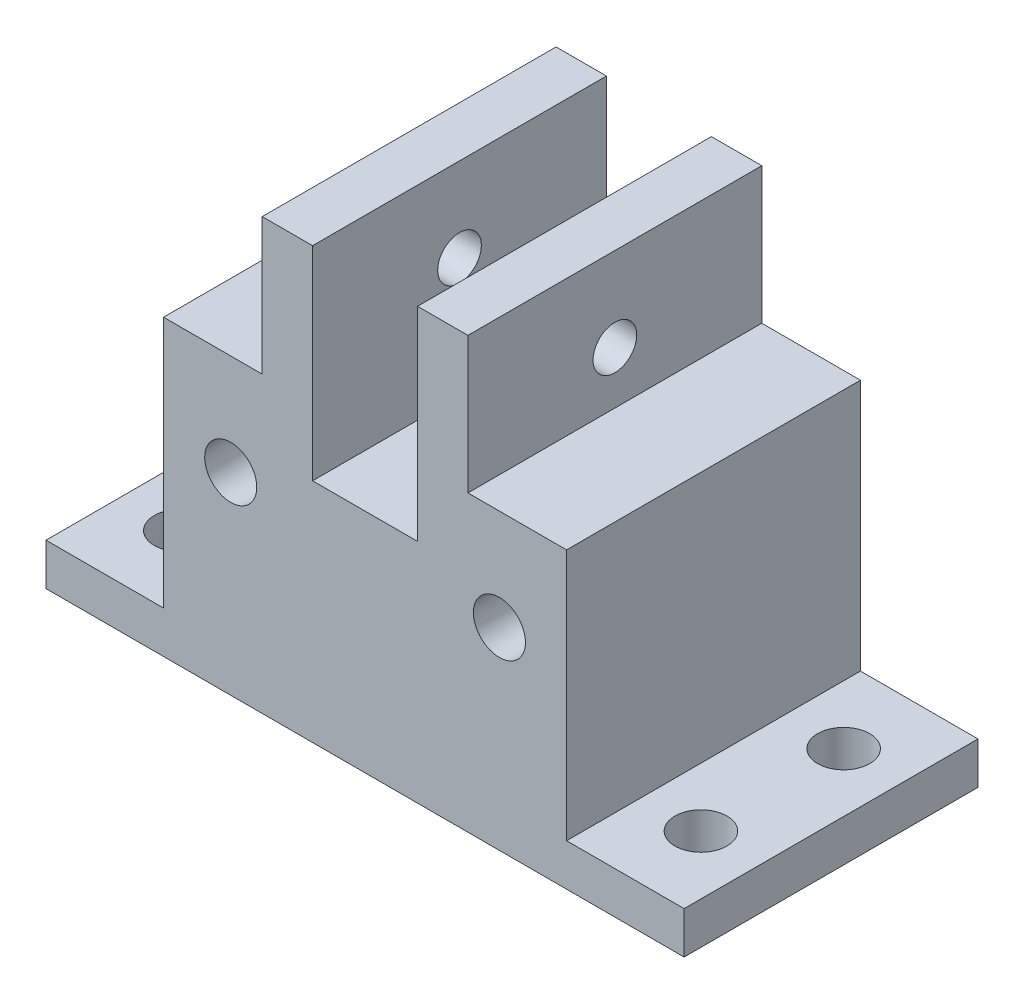
ISO-10303-21;
HEADER;
FILE_DESCRIPTION(('STEP AP214'),'2;1');
FILE_NAME('part.step','',(''),(''),'','','');
FILE_SCHEMA(('AUTOMOTIVE_DESIGN { 1 0 10303 214 1 1 1 1 }'));
ENDSEC;
DATA;
#1=APPLICATION_CONTEXT('core data for automotive mechanical design processes');
#2=APPLICATION_PROTOCOL_DEFINITION('international standard','automotive_design',2000,#1);
#3=PRODUCT_CONTEXT('',#1,'mechanical');
#4=PRODUCT('Part','Part','',(#3));
#5=PRODUCT_RELATED_PRODUCT_CATEGORY('part','',(#4));
#6=PRODUCT_DEFINITION_FORMATION('','',#4);
#7=PRODUCT_DEFINITION_CONTEXT('part definition',#1,'design');
#8=PRODUCT_DEFINITION('design','',#6,#7);
#9=PRODUCT_DEFINITION_SHAPE('','',#8);
#10=(LENGTH_UNIT() NAMED_UNIT(*) SI_UNIT(.MILLI.,.METRE.));
#11=(NAMED_UNIT(*) PLANE_ANGLE_UNIT() SI_UNIT($,.RADIAN.));
#12=(NAMED_UNIT(*) SI_UNIT($,.STERADIAN.) SOLID_ANGLE_UNIT());
#13=UNCERTAINTY_MEASURE_WITH_UNIT(LENGTH_MEASURE(1.E-05),#10,'distance_accuracy_value','');
#14=(GEOMETRIC_REPRESENTATION_CONTEXT(3) GLOBAL_UNCERTAINTY_ASSIGNED_CONTEXT((#13)) GLOBAL_UNIT_ASSIGNED_CONTEXT((#10,
#11,#12)) REPRESENTATION_CONTEXT('',''));
#15=CARTESIAN_POINT('',(0.,0.,0.));
#16=DIRECTION('',(0.,0.,1.));
#17=DIRECTION('',(1.,0.,0.));
#18=AXIS2_PLACEMENT_3D('',#15,#16,#17);
#19=CARTESIAN_POINT('',(-4.9999999999991,-3.75000000000025,35.));
#20=DIRECTION('',(0.,-1.,0.));
#21=DIRECTION('',(0.,0.,-1.));
#22=AXIS2_PLACEMENT_3D('',#19,#20,#21);
#23=PLANE('',#22);
#24=DIRECTION('',(-1.,0.,0.));
#25=VECTOR('',#24,1.);
#26=CARTESIAN_POINT('',(-4.9999999999991,-3.75000000000025,35.));
#27=LINE('',#26,#25);
#28=CARTESIAN_POINT('',(-23.2499999999998,-3.75000000000025,35.));
#29=VERTEX_POINT('',#28);
#30=CARTESIAN_POINT('',(-35.,-3.75000000000025,35.));
#31=VERTEX_POINT('',#30);
#32=EDGE_CURVE('E358',#29,#31,#27,.T.);
#33=ORIENTED_EDGE('',*,*,#32,.F.);
#34=DIRECTION('',(0.,0.,-1.));
#35=VECTOR('',#34,1.);
#36=CARTESIAN_POINT('',(-23.2499999999998,-3.75000000000025,35.));
#37=LINE('',#36,#35);
#38=CARTESIAN_POINT('',(-23.2499999999998,-3.75000000000025,0.));
#39=VERTEX_POINT('',#38);
#40=EDGE_CURVE('E53',#29,#39,#37,.T.);
#41=ORIENTED_EDGE('',*,*,#40,.T.);
#42=DIRECTION('',(-1.,0.,0.));
#43=VECTOR('',#42,1.);
#44=CARTESIAN_POINT('',(-4.9999999999991,-3.75000000000025,0.));
#45=LINE('',#44,#43);
#46=CARTESIAN_POINT('',(-35.,-3.75000000000025,0.));
#47=VERTEX_POINT('',#46);
#48=EDGE_CURVE('E371',#39,#47,#45,.T.);
#49=ORIENTED_EDGE('',*,*,#48,.T.);
#50=DIRECTION('',(0.,0.,-1.));
#51=VECTOR('',#50,1.);
#52=CARTESIAN_POINT('',(-35.,-3.75000000000025,35.));
#53=LINE('',#52,#51);
#54=EDGE_CURVE('E368',#31,#47,#53,.T.);
#55=ORIENTED_EDGE('',*,*,#54,.F.);
#56=EDGE_LOOP('',(#33,#41,#49,#55));
#57=FACE_BOUND('',#56,.T.);
#58=ADVANCED_FACE('F43',(#57),#23,.F.);
#59=CARTESIAN_POINT('',(5.00000000000002,-15.75,35.));
#60=DIRECTION('',(0.,0.,-1.));
#61=DIRECTION('',(-1.,0.,0.));
#62=AXIS2_PLACEMENT_3D('',#59,#60,#61);
#63=CYLINDRICAL_SURFACE('',#62,3.1);
#64=CARTESIAN_POINT('',(5.00000000000002,-15.75,35.));
#65=DIRECTION('',(0.,0.,1.));
#66=DIRECTION('',(1.,0.,0.));
#67=AXIS2_PLACEMENT_3D('',#64,#65,#66);
#68=CIRCLE('',#67,3.1);
#69=CARTESIAN_POINT('',(8.10000000000002,-15.75,35.));
#70=VERTEX_POINT('',#69);
#71=EDGE_CURVE('E350',#70,#70,#68,.T.);
#72=ORIENTED_EDGE('',*,*,#71,.T.);
#73=EDGE_LOOP('',(#72));
#74=FACE_BOUND('',#73,.T.);
#75=CARTESIAN_POINT('',(5.00000000000002,-15.75,5.));
#76=DIRECTION('',(0.,0.,-1.));
#77=DIRECTION('',(-1.,0.,0.));
#78=AXIS2_PLACEMENT_3D('',#75,#76,#77);
#79=CIRCLE('',#78,3.1);
#80=CARTESIAN_POINT('',(1.90000000000002,-15.75,5.));
#81=VERTEX_POINT('',#80);
#82=EDGE_CURVE('E338',#81,#81,#79,.T.);
#83=ORIENTED_EDGE('',*,*,#82,.T.);
#84=EDGE_LOOP('',(#83));
#85=FACE_BOUND('',#84,.T.);
#86=ADVANCED_FACE('F461',(#74,#85),#63,.F.);
#87=CARTESIAN_POINT('',(-27.,-15.7500000000003,35.));
#88=DIRECTION('',(0.,0.,-1.));
#89=DIRECTION('',(-1.,0.,0.));
#90=AXIS2_PLACEMENT_3D('',#87,#88,#89);
#91=CYLINDRICAL_SURFACE('',#90,3.1);
#92=CARTESIAN_POINT('',(-27.,-15.7500000000003,35.));
#93=DIRECTION('',(0.,0.,1.));
#94=DIRECTION('',(1.,0.,0.));
#95=AXIS2_PLACEMENT_3D('',#92,#93,#94);
#96=CIRCLE('',#95,3.1);
#97=CARTESIAN_POINT('',(-23.9,-15.7500000000003,35.));
#98=VERTEX_POINT('',#97);
#99=EDGE_CURVE('E346',#98,#98,#96,.T.);
#100=ORIENTED_EDGE('',*,*,#99,.T.);
#101=EDGE_LOOP('',(#100));
#102=FACE_BOUND('',#101,.T.);
#103=CARTESIAN_POINT('',(-27.,-15.7500000000003,5.));
#104=DIRECTION('',(0.,0.,-1.));
#105=DIRECTION('',(-1.,0.,0.));
#106=AXIS2_PLACEMENT_3D('',#103,#104,#105);
#107=CIRCLE('',#106,3.1);
#108=CARTESIAN_POINT('',(-30.1,-15.7500000000003,5.));
#109=VERTEX_POINT('',#108);
#110=EDGE_CURVE('E342',#109,#109,#107,.T.);
#111=ORIENTED_EDGE('',*,*,#110,.T.);
#112=EDGE_LOOP('',(#111));
#113=FACE_BOUND('',#112,.T.);
#114=ADVANCED_FACE('F465',(#102,#113),#91,.F.);
#115=CARTESIAN_POINT('',(0.,0.,35.));
#116=DIRECTION('',(0.,0.,-1.));
#117=DIRECTION('',(-1.,0.,0.));
#118=AXIS2_PLACEMENT_3D('',#115,#116,#117);
#119=PLANE('',#118);
#120=DIRECTION('',(0.,-1.,0.));
#121=VECTOR('',#120,1.);
#122=CARTESIAN_POINT('',(-4.7499999999998,2.49999999999976,35.));
#123=LINE('',#122,#121);
#124=CARTESIAN_POINT('',(-4.7499999999998,12.4999999999998,35.));
#125=VERTEX_POINT('',#124);
#126=CARTESIAN_POINT('',(-4.7499999999998,-11.7500000000003,35.));
#127=VERTEX_POINT('',#126);
#128=EDGE_CURVE('E301',#125,#127,#123,.T.);
#129=ORIENTED_EDGE('',*,*,#128,.T.);
#130=DIRECTION('',(1.,0.,0.));
#131=VECTOR('',#130,1.);
#132=CARTESIAN_POINT('',(-17.2499999999998,-11.7500000000003,35.));
#133=LINE('',#132,#131);
#134=CARTESIAN_POINT('',(-17.2499999999998,-11.7500000000003,35.));
#135=VERTEX_POINT('',#134);
#136=EDGE_CURVE('E256',#135,#127,#133,.T.);
#137=ORIENTED_EDGE('',*,*,#136,.F.);
#138=DIRECTION('',(0.,1.,0.));
#139=VECTOR('',#138,1.);
#140=CARTESIAN_POINT('',(-17.2499999999998,2.49999999999976,35.));
#141=LINE('',#140,#139);
#142=CARTESIAN_POINT('',(-17.2499999999998,12.4999999999998,35.));
#143=VERTEX_POINT('',#142);
#144=EDGE_CURVE('E310',#135,#143,#141,.T.);
#145=ORIENTED_EDGE('',*,*,#144,.T.);
#146=DIRECTION('',(-1.,0.,0.));
#147=VECTOR('',#146,1.);
#148=CARTESIAN_POINT('',(-17.2499999999998,12.4999999999998,35.));
#149=LINE('',#148,#147);
#150=CARTESIAN_POINT('',(-23.2499999999998,12.4999999999998,35.));
#151=VERTEX_POINT('',#150);
#152=EDGE_CURVE('E313',#143,#151,#149,.T.);
#153=ORIENTED_EDGE('',*,*,#152,.T.);
#154=DIRECTION('',(0.,-1.,0.));
#155=VECTOR('',#154,1.);
#156=CARTESIAN_POINT('',(-23.2499999999998,12.4999999999998,35.));
#157=LINE('',#156,#155);
#158=EDGE_CURVE('E314',#151,#29,#157,.T.);
#159=ORIENTED_EDGE('',*,*,#158,.T.);
#160=ORIENTED_EDGE('',*,*,#32,.T.);
#161=DIRECTION('',(0.,-1.,0.));
#162=VECTOR('',#161,1.);
#163=CARTESIAN_POINT('',(-35.,-3.75000000000025,35.));
#164=LINE('',#163,#162);
#165=CARTESIAN_POINT('',(-34.9999999999998,-33.7500000000002,35.));
#166=VERTEX_POINT('',#165);
#167=EDGE_CURVE('E364',#31,#166,#164,.T.);
#168=ORIENTED_EDGE('',*,*,#167,.T.);
#169=DIRECTION('',(-1.,0.,0.));
#170=VECTOR('',#169,1.);
#171=CARTESIAN_POINT('',(-34.9999999999998,-33.7500000000002,35.));
#172=LINE('',#171,#170);
#173=CARTESIAN_POINT('',(-48.9999999999998,-33.7500000000002,35.));
#174=VERTEX_POINT('',#173);
#175=EDGE_CURVE('E68',#166,#174,#172,.T.);
#176=ORIENTED_EDGE('',*,*,#175,.T.);
#177=DIRECTION('',(0.,-1.,0.));
#178=VECTOR('',#177,1.);
#179=CARTESIAN_POINT('',(-48.9999999999998,-33.7500000000002,35.));
#180=LINE('',#179,#178);
#181=CARTESIAN_POINT('',(-48.9999999999998,-38.7500000000002,35.));
#182=VERTEX_POINT('',#181);
#183=EDGE_CURVE('E246',#174,#182,#180,.T.);
#184=ORIENTED_EDGE('',*,*,#183,.T.);
#185=DIRECTION('',(-1.,0.,0.));
#186=VECTOR('',#185,1.);
#187=CARTESIAN_POINT('',(13.0000000000002,-38.7500000000002,35.));
#188=LINE('',#187,#186);
#189=CARTESIAN_POINT('',(27.0000000000002,-38.7500000000002,35.));
#190=VERTEX_POINT('',#189);
#191=EDGE_CURVE('E171',#190,#182,#188,.T.);
#192=ORIENTED_EDGE('',*,*,#191,.F.);
#193=DIRECTION('',(0.,-1.,0.));
#194=VECTOR('',#193,1.);
#195=CARTESIAN_POINT('',(27.0000000000002,-33.7500000000002,35.));
#196=LINE('',#195,#194);
#197=CARTESIAN_POINT('',(27.0000000000002,-33.7500000000002,35.));
#198=VERTEX_POINT('',#197);
#199=EDGE_CURVE('E181',#198,#190,#196,.T.);
#200=ORIENTED_EDGE('',*,*,#199,.F.);
#201=DIRECTION('',(-1.,0.,0.));
#202=VECTOR('',#201,1.);
#203=CARTESIAN_POINT('',(13.0000000000002,-33.7500000000002,35.));
#204=LINE('',#203,#202);
#205=CARTESIAN_POINT('',(13.0000000000002,-33.7500000000002,35.));
#206=VERTEX_POINT('',#205);
#207=EDGE_CURVE('E194',#198,#206,#204,.T.);
#208=ORIENTED_EDGE('',*,*,#207,.T.);
#209=DIRECTION('',(0.,1.,0.));
#210=VECTOR('',#209,1.);
#211=CARTESIAN_POINT('',(13.0000000000002,-28.7500000000002,35.));
#212=LINE('',#211,#210);
#213=CARTESIAN_POINT('',(13.0000000000002,-3.75000000000025,35.));
#214=VERTEX_POINT('',#213);
#215=EDGE_CURVE('E355',#206,#214,#212,.T.);
#216=ORIENTED_EDGE('',*,*,#215,.T.);
#217=CARTESIAN_POINT('',(1.25000000000019,-3.75000000000025,35.));
#218=VERTEX_POINT('',#217);
#219=EDGE_CURVE('E360',#214,#218,#27,.T.);
#220=ORIENTED_EDGE('',*,*,#219,.T.);
#221=DIRECTION('',(0.,1.,0.));
#222=VECTOR('',#221,1.);
#223=CARTESIAN_POINT('',(1.2500000000002,12.4999999999998,35.));
#224=LINE('',#223,#222);
#225=CARTESIAN_POINT('',(1.2500000000002,12.4999999999998,35.));
#226=VERTEX_POINT('',#225);
#227=EDGE_CURVE('E300',#218,#226,#224,.T.);
#228=ORIENTED_EDGE('',*,*,#227,.T.);
#229=DIRECTION('',(-1.,0.,0.));
#230=VECTOR('',#229,1.);
#231=CARTESIAN_POINT('',(-4.7499999999998,12.4999999999998,35.));
#232=LINE('',#231,#230);
#233=EDGE_CURVE('E304',#226,#125,#232,.T.);
#234=ORIENTED_EDGE('',*,*,#233,.T.);
#235=EDGE_LOOP('',(#129,#137,#145,#153,#159,#160,#168,#176,#184,#192,#200,#208,#216,#220,#228,#234));
#236=FACE_BOUND('',#235,.T.);
#237=ORIENTED_EDGE('',*,*,#71,.F.);
#238=EDGE_LOOP('',(#237));
#239=FACE_BOUND('',#238,.T.);
#240=ORIENTED_EDGE('',*,*,#99,.F.);
#241=EDGE_LOOP('',(#240));
#242=FACE_BOUND('',#241,.T.);
#243=ADVANCED_FACE('F423',(#236,#239,#242),#119,.F.);
#244=CARTESIAN_POINT('',(0.,0.,0.));
#245=DIRECTION('',(0.,0.,-1.));
#246=DIRECTION('',(-1.,0.,0.));
#247=AXIS2_PLACEMENT_3D('',#244,#245,#246);
#248=PLANE('',#247);
#249=DIRECTION('',(1.,0.,0.));
#250=VECTOR('',#249,1.);
#251=CARTESIAN_POINT('',(-17.2499999999998,-11.7500000000003,0.));
#252=LINE('',#251,#250);
#253=CARTESIAN_POINT('',(-17.2499999999998,-11.7500000000003,0.));
#254=VERTEX_POINT('',#253);
#255=CARTESIAN_POINT('',(-4.7499999999998,-11.7500000000003,0.));
#256=VERTEX_POINT('',#255);
#257=EDGE_CURVE('E257',#254,#256,#252,.T.);
#258=ORIENTED_EDGE('',*,*,#257,.T.);
#259=DIRECTION('',(0.,-1.,0.));
#260=VECTOR('',#259,1.);
#261=CARTESIAN_POINT('',(-4.7499999999998,2.49999999999976,0.));
#262=LINE('',#261,#260);
#263=CARTESIAN_POINT('',(-4.7499999999998,12.4999999999998,0.));
#264=VERTEX_POINT('',#263);
#265=EDGE_CURVE('E294',#264,#256,#262,.T.);
#266=ORIENTED_EDGE('',*,*,#265,.F.);
#267=DIRECTION('',(-1.,0.,0.));
#268=VECTOR('',#267,1.);
#269=CARTESIAN_POINT('',(-4.7499999999998,12.4999999999998,0.));
#270=LINE('',#269,#268);
#271=CARTESIAN_POINT('',(1.2500000000002,12.4999999999998,0.));
#272=VERTEX_POINT('',#271);
#273=EDGE_CURVE('E289',#272,#264,#270,.T.);
#274=ORIENTED_EDGE('',*,*,#273,.F.);
#275=DIRECTION('',(0.,1.,0.));
#276=VECTOR('',#275,1.);
#277=CARTESIAN_POINT('',(1.2500000000002,12.4999999999998,0.));
#278=LINE('',#277,#276);
#279=CARTESIAN_POINT('',(1.25000000000019,-3.75000000000025,0.));
#280=VERTEX_POINT('',#279);
#281=EDGE_CURVE('E288',#280,#272,#278,.T.);
#282=ORIENTED_EDGE('',*,*,#281,.F.);
#283=CARTESIAN_POINT('',(13.0000000000002,-3.75000000000025,0.));
#284=VERTEX_POINT('',#283);
#285=EDGE_CURVE('E372',#284,#280,#45,.T.);
#286=ORIENTED_EDGE('',*,*,#285,.F.);
#287=DIRECTION('',(0.,1.,0.));
#288=VECTOR('',#287,1.);
#289=CARTESIAN_POINT('',(13.0000000000002,-28.7500000000002,0.));
#290=LINE('',#289,#288);
#291=CARTESIAN_POINT('',(13.0000000000002,-33.7500000000002,0.));
#292=VERTEX_POINT('',#291);
#293=EDGE_CURVE('E354',#292,#284,#290,.T.);
#294=ORIENTED_EDGE('',*,*,#293,.F.);
#295=DIRECTION('',(1.,0.,0.));
#296=VECTOR('',#295,1.);
#297=CARTESIAN_POINT('',(27.0000000000002,-33.7500000000002,0.));
#298=LINE('',#297,#296);
#299=CARTESIAN_POINT('',(27.0000000000002,-33.7500000000002,0.));
#300=VERTEX_POINT('',#299);
#301=EDGE_CURVE('E60',#292,#300,#298,.T.);
#302=ORIENTED_EDGE('',*,*,#301,.T.);
#303=DIRECTION('',(0.,-1.,0.));
#304=VECTOR('',#303,1.);
#305=CARTESIAN_POINT('',(27.0000000000002,-33.7500000000002,0.));
#306=LINE('',#305,#304);
#307=CARTESIAN_POINT('',(27.0000000000002,-38.7500000000002,0.));
#308=VERTEX_POINT('',#307);
#309=EDGE_CURVE('E174',#300,#308,#306,.T.);
#310=ORIENTED_EDGE('',*,*,#309,.T.);
#311=DIRECTION('',(1.,0.,0.));
#312=VECTOR('',#311,1.);
#313=CARTESIAN_POINT('',(-34.9999999999998,-38.7500000000002,0.));
#314=LINE('',#313,#312);
#315=CARTESIAN_POINT('',(-48.9999999999998,-38.7500000000002,0.));
#316=VERTEX_POINT('',#315);
#317=EDGE_CURVE('E160',#316,#308,#314,.T.);
#318=ORIENTED_EDGE('',*,*,#317,.F.);
#319=DIRECTION('',(0.,-1.,0.));
#320=VECTOR('',#319,1.);
#321=CARTESIAN_POINT('',(-48.9999999999998,-33.7500000000002,0.));
#322=LINE('',#321,#320);
#323=CARTESIAN_POINT('',(-48.9999999999998,-33.7500000000002,0.));
#324=VERTEX_POINT('',#323);
#325=EDGE_CURVE('E172',#324,#316,#322,.T.);
#326=ORIENTED_EDGE('',*,*,#325,.F.);
#327=DIRECTION('',(1.,0.,0.));
#328=VECTOR('',#327,1.);
#329=CARTESIAN_POINT('',(-48.9999999999998,-33.7500000000002,0.));
#330=LINE('',#329,#328);
#331=CARTESIAN_POINT('',(-34.9999999999998,-33.7500000000002,0.));
#332=VERTEX_POINT('',#331);
#333=EDGE_CURVE('E242',#324,#332,#330,.T.);
#334=ORIENTED_EDGE('',*,*,#333,.T.);
#335=DIRECTION('',(0.,-1.,0.));
#336=VECTOR('',#335,1.);
#337=CARTESIAN_POINT('',(-35.,-3.75000000000025,0.));
#338=LINE('',#337,#336);
#339=EDGE_CURVE('E359',#47,#332,#338,.T.);
#340=ORIENTED_EDGE('',*,*,#339,.F.);
#341=ORIENTED_EDGE('',*,*,#48,.F.);
#342=DIRECTION('',(0.,-1.,0.));
#343=VECTOR('',#342,1.);
#344=CARTESIAN_POINT('',(-23.2499999999998,12.4999999999998,0.));
#345=LINE('',#344,#343);
#346=CARTESIAN_POINT('',(-23.2499999999998,12.4999999999998,0.));
#347=VERTEX_POINT('',#346);
#348=EDGE_CURVE('E330',#347,#39,#345,.T.);
#349=ORIENTED_EDGE('',*,*,#348,.F.);
#350=DIRECTION('',(-1.,0.,0.));
#351=VECTOR('',#350,1.);
#352=CARTESIAN_POINT('',(-17.2499999999998,12.4999999999998,0.));
#353=LINE('',#352,#351);
#354=CARTESIAN_POINT('',(-17.2499999999998,12.4999999999998,0.));
#355=VERTEX_POINT('',#354);
#356=EDGE_CURVE('E318',#355,#347,#353,.T.);
#357=ORIENTED_EDGE('',*,*,#356,.F.);
#358=DIRECTION('',(0.,1.,0.));
#359=VECTOR('',#358,1.);
#360=CARTESIAN_POINT('',(-17.2499999999998,2.49999999999976,0.));
#361=LINE('',#360,#359);
#362=EDGE_CURVE('E326',#254,#355,#361,.T.);
#363=ORIENTED_EDGE('',*,*,#362,.F.);
#364=EDGE_LOOP('',(#258,#266,#274,#282,#286,#294,#302,#310,#318,#326,#334,#340,#341,#349,#357,#363));
#365=FACE_BOUND('',#364,.T.);
#366=ADVANCED_FACE('F176',(#365),#248,.T.);
#367=CARTESIAN_POINT('',(13.0000000000002,-28.7500000000002,35.));
#368=DIRECTION('',(-1.,0.,0.));
#369=DIRECTION('',(0.,0.,1.));
#370=AXIS2_PLACEMENT_3D('',#367,#368,#369);
#371=PLANE('',#370);
#372=ORIENTED_EDGE('',*,*,#215,.F.);
#373=DIRECTION('',(0.,0.,-1.));
#374=VECTOR('',#373,1.);
#375=CARTESIAN_POINT('',(13.0000000000002,-33.7500000000002,35.));
#376=LINE('',#375,#374);
#377=EDGE_CURVE('E200',#206,#292,#376,.T.);
#378=ORIENTED_EDGE('',*,*,#377,.T.);
#379=ORIENTED_EDGE('',*,*,#293,.T.);
#380=DIRECTION('',(0.,0.,-1.));
#381=VECTOR('',#380,1.);
#382=CARTESIAN_POINT('',(13.0000000000002,-3.75000000000025,35.));
#383=LINE('',#382,#381);
#384=EDGE_CURVE('E382',#214,#284,#383,.T.);
#385=ORIENTED_EDGE('',*,*,#384,.F.);
#386=EDGE_LOOP('',(#372,#378,#379,#385));
#387=FACE_BOUND('',#386,.T.);
#388=ADVANCED_FACE('F45',(#387),#371,.F.);
#389=ORIENTED_EDGE('',*,*,#285,.T.);
#390=DIRECTION('',(0.,0.,1.));
#391=VECTOR('',#390,1.);
#392=CARTESIAN_POINT('',(1.25000000000019,-3.75000000000025,35.));
#393=LINE('',#392,#391);
#394=EDGE_CURVE('E11',#280,#218,#393,.T.);
#395=ORIENTED_EDGE('',*,*,#394,.T.);
#396=ORIENTED_EDGE('',*,*,#219,.F.);
#397=ORIENTED_EDGE('',*,*,#384,.T.);
#398=EDGE_LOOP('',(#389,#395,#396,#397));
#399=FACE_BOUND('',#398,.T.);
#400=ADVANCED_FACE('F416',(#399),#23,.F.);
#401=CARTESIAN_POINT('',(-35.,-3.75000000000025,35.));
#402=DIRECTION('',(1.,0.,0.));
#403=DIRECTION('',(0.,1.,0.));
#404=AXIS2_PLACEMENT_3D('',#401,#402,#403);
#405=PLANE('',#404);
#406=ORIENTED_EDGE('',*,*,#339,.T.);
#407=DIRECTION('',(0.,0.,1.));
#408=VECTOR('',#407,1.);
#409=CARTESIAN_POINT('',(-34.9999999999998,-33.7500000000002,35.));
#410=LINE('',#409,#408);
#411=EDGE_CURVE('E233',#332,#166,#410,.T.);
#412=ORIENTED_EDGE('',*,*,#411,.T.);
#413=ORIENTED_EDGE('',*,*,#167,.F.);
#414=ORIENTED_EDGE('',*,*,#54,.T.);
#415=EDGE_LOOP('',(#406,#412,#413,#414));
#416=FACE_BOUND('',#415,.T.);
#417=ADVANCED_FACE('F430',(#416),#405,.F.);
#418=CARTESIAN_POINT('',(-27.,-15.7500000000003,5.));
#419=DIRECTION('',(0.,0.,-1.));
#420=DIRECTION('',(-1.,0.,0.));
#421=AXIS2_PLACEMENT_3D('',#418,#419,#420);
#422=PLANE('',#421);
#423=ORIENTED_EDGE('',*,*,#110,.F.);
#424=EDGE_LOOP('',(#423));
#425=FACE_BOUND('',#424,.T.);
#426=ADVANCED_FACE('F474',(#425),#422,.F.);
#427=CARTESIAN_POINT('',(5.00000000000002,-15.75,5.));
#428=DIRECTION('',(0.,0.,-1.));
#429=DIRECTION('',(-1.,0.,0.));
#430=AXIS2_PLACEMENT_3D('',#427,#428,#429);
#431=PLANE('',#430);
#432=ORIENTED_EDGE('',*,*,#82,.F.);
#433=EDGE_LOOP('',(#432));
#434=FACE_BOUND('',#433,.T.);
#435=ADVANCED_FACE('F489',(#434),#431,.F.);
#436=CARTESIAN_POINT('',(-23.2499999999998,12.4999999999998,-20.8806130178211));
#437=DIRECTION('',(-1.,0.,0.));
#438=DIRECTION('',(0.,-1.,0.));
#439=AXIS2_PLACEMENT_3D('',#436,#437,#438);
#440=PLANE('',#439);
#441=CARTESIAN_POINT('',(-23.2499999999998,2.49999999999975,17.5));
#442=DIRECTION('',(-1.,0.,0.));
#443=DIRECTION('',(0.,0.,1.));
#444=AXIS2_PLACEMENT_3D('',#441,#442,#443);
#445=CIRCLE('',#444,2.6);
#446=CARTESIAN_POINT('',(-23.2499999999998,2.49999999999975,20.1));
#447=VERTEX_POINT('',#446);
#448=EDGE_CURVE('E268',#447,#447,#445,.T.);
#449=ORIENTED_EDGE('',*,*,#448,.F.);
#450=EDGE_LOOP('',(#449));
#451=FACE_BOUND('',#450,.T.);
#452=ORIENTED_EDGE('',*,*,#40,.F.);
#453=ORIENTED_EDGE('',*,*,#158,.F.);
#454=DIRECTION('',(0.,0.,1.));
#455=VECTOR('',#454,1.);
#456=CARTESIAN_POINT('',(-23.2499999999998,12.4999999999998,-20.8806130178211));
#457=LINE('',#456,#455);
#458=EDGE_CURVE('E325',#347,#151,#457,.T.);
#459=ORIENTED_EDGE('',*,*,#458,.F.);
#460=ORIENTED_EDGE('',*,*,#348,.T.);
#461=EDGE_LOOP('',(#452,#453,#459,#460));
#462=FACE_BOUND('',#461,.T.);
#463=ADVANCED_FACE('F434',(#451,#462),#440,.T.);
#464=CARTESIAN_POINT('',(-17.2499999999998,2.49999999999976,-20.8806130178211));
#465=DIRECTION('',(1.,0.,0.));
#466=DIRECTION('',(0.,0.,-1.));
#467=AXIS2_PLACEMENT_3D('',#464,#465,#466);
#468=PLANE('',#467);
#469=CARTESIAN_POINT('',(-17.2499999999998,2.49999999999975,17.5));
#470=DIRECTION('',(1.,0.,0.));
#471=DIRECTION('',(0.,0.,-1.));
#472=AXIS2_PLACEMENT_3D('',#469,#470,#471);
#473=CIRCLE('',#472,2.6);
#474=CARTESIAN_POINT('',(-17.2499999999998,2.49999999999975,14.9));
#475=VERTEX_POINT('',#474);
#476=EDGE_CURVE('E279',#475,#475,#473,.T.);
#477=ORIENTED_EDGE('',*,*,#476,.F.);
#478=EDGE_LOOP('',(#477));
#479=FACE_BOUND('',#478,.T.);
#480=ORIENTED_EDGE('',*,*,#144,.F.);
#481=DIRECTION('',(0.,0.,1.));
#482=VECTOR('',#481,1.);
#483=CARTESIAN_POINT('',(-17.2499999999998,-11.7500000000003,0.));
#484=LINE('',#483,#482);
#485=EDGE_CURVE('E260',#254,#135,#484,.T.);
#486=ORIENTED_EDGE('',*,*,#485,.F.);
#487=ORIENTED_EDGE('',*,*,#362,.T.);
#488=DIRECTION('',(0.,0.,1.));
#489=VECTOR('',#488,1.);
#490=CARTESIAN_POINT('',(-17.2499999999998,12.4999999999998,-20.8806130178211));
#491=LINE('',#490,#489);
#492=EDGE_CURVE('E329',#355,#143,#491,.T.);
#493=ORIENTED_EDGE('',*,*,#492,.T.);
#494=EDGE_LOOP('',(#480,#486,#487,#493));
#495=FACE_BOUND('',#494,.T.);
#496=ADVANCED_FACE('F441',(#479,#495),#468,.T.);
#497=CARTESIAN_POINT('',(-17.2499999999998,12.4999999999998,-20.8806130178211));
#498=DIRECTION('',(0.,1.,0.));
#499=DIRECTION('',(-1.,0.,0.));
#500=AXIS2_PLACEMENT_3D('',#497,#498,#499);
#501=PLANE('',#500);
#502=ORIENTED_EDGE('',*,*,#492,.F.);
#503=ORIENTED_EDGE('',*,*,#356,.T.);
#504=ORIENTED_EDGE('',*,*,#458,.T.);
#505=ORIENTED_EDGE('',*,*,#152,.F.);
#506=EDGE_LOOP('',(#502,#503,#504,#505));
#507=FACE_BOUND('',#506,.T.);
#508=ADVANCED_FACE('F437',(#507),#501,.T.);
#509=CARTESIAN_POINT('',(-4.7499999999998,2.49999999999976,-20.8806130178211));
#510=DIRECTION('',(-1.,0.,0.));
#511=DIRECTION('',(0.,0.,1.));
#512=AXIS2_PLACEMENT_3D('',#509,#510,#511);
#513=PLANE('',#512);
#514=CARTESIAN_POINT('',(-4.7499999999998,2.49999999999975,17.5));
#515=DIRECTION('',(-1.,0.,0.));
#516=DIRECTION('',(0.,0.,1.));
#517=AXIS2_PLACEMENT_3D('',#514,#515,#516);
#518=CIRCLE('',#517,2.6);
#519=CARTESIAN_POINT('',(-4.7499999999998,2.49999999999975,20.1));
#520=VERTEX_POINT('',#519);
#521=EDGE_CURVE('E275',#520,#520,#518,.T.);
#522=ORIENTED_EDGE('',*,*,#521,.F.);
#523=EDGE_LOOP('',(#522));
#524=FACE_BOUND('',#523,.T.);
#525=ORIENTED_EDGE('',*,*,#265,.T.);
#526=DIRECTION('',(0.,0.,1.));
#527=VECTOR('',#526,1.);
#528=CARTESIAN_POINT('',(-4.7499999999998,-11.7500000000003,0.));
#529=LINE('',#528,#527);
#530=EDGE_CURVE('E264',#256,#127,#529,.T.);
#531=ORIENTED_EDGE('',*,*,#530,.T.);
#532=ORIENTED_EDGE('',*,*,#128,.F.);
#533=DIRECTION('',(0.,0.,1.));
#534=VECTOR('',#533,1.);
#535=CARTESIAN_POINT('',(-4.7499999999998,12.4999999999998,-20.8806130178211));
#536=LINE('',#535,#534);
#537=EDGE_CURVE('E283',#264,#125,#536,.T.);
#538=ORIENTED_EDGE('',*,*,#537,.F.);
#539=EDGE_LOOP('',(#525,#531,#532,#538));
#540=FACE_BOUND('',#539,.T.);
#541=ADVANCED_FACE('F408',(#524,#540),#513,.T.);
#542=CARTESIAN_POINT('',(1.2500000000002,12.4999999999998,-20.8806130178211));
#543=DIRECTION('',(1.,0.,0.));
#544=DIRECTION('',(0.,1.,0.));
#545=AXIS2_PLACEMENT_3D('',#542,#543,#544);
#546=PLANE('',#545);
#547=CARTESIAN_POINT('',(1.25000000000019,2.49999999999975,17.5));
#548=DIRECTION('',(1.,0.,0.));
#549=DIRECTION('',(0.,1.,0.));
#550=AXIS2_PLACEMENT_3D('',#547,#548,#549);
#551=CIRCLE('',#550,2.6);
#552=CARTESIAN_POINT('',(1.25000000000019,5.09999999999975,17.5));
#553=VERTEX_POINT('',#552);
#554=EDGE_CURVE('E47',#553,#553,#551,.T.);
#555=ORIENTED_EDGE('',*,*,#554,.F.);
#556=EDGE_LOOP('',(#555));
#557=FACE_BOUND('',#556,.T.);
#558=ORIENTED_EDGE('',*,*,#394,.F.);
#559=ORIENTED_EDGE('',*,*,#281,.T.);
#560=DIRECTION('',(0.,0.,1.));
#561=VECTOR('',#560,1.);
#562=CARTESIAN_POINT('',(1.2500000000002,12.4999999999998,-20.8806130178211));
#563=LINE('',#562,#561);
#564=EDGE_CURVE('E284',#272,#226,#563,.T.);
#565=ORIENTED_EDGE('',*,*,#564,.T.);
#566=ORIENTED_EDGE('',*,*,#227,.F.);
#567=EDGE_LOOP('',(#558,#559,#565,#566));
#568=FACE_BOUND('',#567,.T.);
#569=ADVANCED_FACE('F404',(#557,#568),#546,.T.);
#570=CARTESIAN_POINT('',(-4.7499999999998,12.4999999999998,-20.8806130178211));
#571=DIRECTION('',(0.,1.,0.));
#572=DIRECTION('',(-1.,0.,0.));
#573=AXIS2_PLACEMENT_3D('',#570,#571,#572);
#574=PLANE('',#573);
#575=ORIENTED_EDGE('',*,*,#564,.F.);
#576=ORIENTED_EDGE('',*,*,#273,.T.);
#577=ORIENTED_EDGE('',*,*,#537,.T.);
#578=ORIENTED_EDGE('',*,*,#233,.F.);
#579=EDGE_LOOP('',(#575,#576,#577,#578));
#580=FACE_BOUND('',#579,.T.);
#581=ADVANCED_FACE('F407',(#580),#574,.T.);
#582=CARTESIAN_POINT('',(13.0000000000002,2.49999999999975,17.5));
#583=DIRECTION('',(-1.,0.,0.));
#584=DIRECTION('',(0.,0.,1.));
#585=AXIS2_PLACEMENT_3D('',#582,#583,#584);
#586=CYLINDRICAL_SURFACE('',#585,2.6);
#587=ORIENTED_EDGE('',*,*,#521,.T.);
#588=EDGE_LOOP('',(#587));
#589=FACE_BOUND('',#588,.T.);
#590=ORIENTED_EDGE('',*,*,#554,.T.);
#591=EDGE_LOOP('',(#590));
#592=FACE_BOUND('',#591,.T.);
#593=ADVANCED_FACE('F402',(#589,#592),#586,.F.);
#594=ORIENTED_EDGE('',*,*,#476,.T.);
#595=EDGE_LOOP('',(#594));
#596=FACE_BOUND('',#595,.T.);
#597=ORIENTED_EDGE('',*,*,#448,.T.);
#598=EDGE_LOOP('',(#597));
#599=FACE_BOUND('',#598,.T.);
#600=ADVANCED_FACE('F456',(#596,#599),#586,.F.);
#601=CARTESIAN_POINT('',(-17.2499999999998,-11.7500000000003,0.));
#602=DIRECTION('',(0.,-1.,0.));
#603=DIRECTION('',(0.,0.,-1.));
#604=AXIS2_PLACEMENT_3D('',#601,#602,#603);
#605=PLANE('',#604);
#606=ORIENTED_EDGE('',*,*,#136,.T.);
#607=ORIENTED_EDGE('',*,*,#530,.F.);
#608=ORIENTED_EDGE('',*,*,#257,.F.);
#609=ORIENTED_EDGE('',*,*,#485,.T.);
#610=EDGE_LOOP('',(#606,#607,#608,#609));
#611=FACE_BOUND('',#610,.T.);
#612=ADVANCED_FACE('F445',(#611),#605,.F.);
#613=CARTESIAN_POINT('',(0.,-38.7500000000002,0.));
#614=DIRECTION('',(0.,-1.,0.));
#615=DIRECTION('',(0.,0.,-1.));
#616=AXIS2_PLACEMENT_3D('',#613,#614,#615);
#617=PLANE('',#616);
#618=ORIENTED_EDGE('',*,*,#191,.T.);
#619=DIRECTION('',(0.,0.,-1.));
#620=VECTOR('',#619,1.);
#621=CARTESIAN_POINT('',(-48.9999999999998,-38.7500000000002,35.));
#622=LINE('',#621,#620);
#623=EDGE_CURVE('E167',#182,#316,#622,.T.);
#624=ORIENTED_EDGE('',*,*,#623,.T.);
#625=ORIENTED_EDGE('',*,*,#317,.T.);
#626=DIRECTION('',(0.,0.,1.));
#627=VECTOR('',#626,1.);
#628=CARTESIAN_POINT('',(27.0000000000002,-38.7500000000002,35.));
#629=LINE('',#628,#627);
#630=EDGE_CURVE('E165',#308,#190,#629,.T.);
#631=ORIENTED_EDGE('',*,*,#630,.T.);
#632=EDGE_LOOP('',(#618,#624,#625,#631));
#633=FACE_BOUND('',#632,.T.);
#634=CARTESIAN_POINT('',(-41.9999999999998,-38.7500000000002,26.));
#635=DIRECTION('',(0.,-1.,0.));
#636=DIRECTION('',(0.,0.,-1.));
#637=AXIS2_PLACEMENT_3D('',#634,#635,#636);
#638=CIRCLE('',#637,3.1);
#639=CARTESIAN_POINT('',(-41.9999999999998,-38.7500000000002,22.9));
#640=VERTEX_POINT('',#639);
#641=EDGE_CURVE('E214',#640,#640,#638,.T.);
#642=ORIENTED_EDGE('',*,*,#641,.F.);
#643=EDGE_LOOP('',(#642));
#644=FACE_BOUND('',#643,.T.);
#645=CARTESIAN_POINT('',(-41.9999999999998,-38.7500000000002,9.));
#646=DIRECTION('',(0.,-1.,0.));
#647=DIRECTION('',(0.,0.,-1.));
#648=AXIS2_PLACEMENT_3D('',#645,#646,#647);
#649=CIRCLE('',#648,3.1);
#650=CARTESIAN_POINT('',(-41.9999999999998,-38.7500000000002,5.9));
#651=VERTEX_POINT('',#650);
#652=EDGE_CURVE('E222',#651,#651,#649,.T.);
#653=ORIENTED_EDGE('',*,*,#652,.F.);
#654=EDGE_LOOP('',(#653));
#655=FACE_BOUND('',#654,.T.);
#656=CARTESIAN_POINT('',(20.0000000000002,-38.7500000000002,26.));
#657=DIRECTION('',(0.,-1.,0.));
#658=DIRECTION('',(0.,0.,-1.));
#659=AXIS2_PLACEMENT_3D('',#656,#657,#658);
#660=CIRCLE('',#659,3.1);
#661=CARTESIAN_POINT('',(20.0000000000002,-38.7500000000002,22.9));
#662=VERTEX_POINT('',#661);
#663=EDGE_CURVE('E210',#662,#662,#660,.T.);
#664=ORIENTED_EDGE('',*,*,#663,.F.);
#665=EDGE_LOOP('',(#664));
#666=FACE_BOUND('',#665,.T.);
#667=CARTESIAN_POINT('',(20.0000000000002,-38.7500000000002,9.00000000000001));
#668=DIRECTION('',(0.,-1.,0.));
#669=DIRECTION('',(0.,0.,1.));
#670=AXIS2_PLACEMENT_3D('',#667,#668,#669);
#671=CIRCLE('',#670,3.1);
#672=CARTESIAN_POINT('',(20.0000000000002,-38.7500000000002,12.1));
#673=VERTEX_POINT('',#672);
#674=EDGE_CURVE('E192',#673,#673,#671,.T.);
#675=ORIENTED_EDGE('',*,*,#674,.F.);
#676=EDGE_LOOP('',(#675));
#677=FACE_BOUND('',#676,.T.);
#678=ADVANCED_FACE('F162',(#633,#644,#655,#666,#677),#617,.T.);
#679=CARTESIAN_POINT('',(-48.9999999999998,-33.7500000000002,35.));
#680=DIRECTION('',(-1.,0.,0.));
#681=DIRECTION('',(0.,0.,1.));
#682=AXIS2_PLACEMENT_3D('',#679,#680,#681);
#683=PLANE('',#682);
#684=ORIENTED_EDGE('',*,*,#623,.F.);
#685=ORIENTED_EDGE('',*,*,#183,.F.);
#686=DIRECTION('',(0.,0.,-1.));
#687=VECTOR('',#686,1.);
#688=CARTESIAN_POINT('',(-48.9999999999998,-33.7500000000002,35.));
#689=LINE('',#688,#687);
#690=EDGE_CURVE('E238',#174,#324,#689,.T.);
#691=ORIENTED_EDGE('',*,*,#690,.T.);
#692=ORIENTED_EDGE('',*,*,#325,.T.);
#693=EDGE_LOOP('',(#684,#685,#691,#692));
#694=FACE_BOUND('',#693,.T.);
#695=ADVANCED_FACE('F427',(#694),#683,.T.);
#696=CARTESIAN_POINT('',(0.,-33.7500000000002,0.));
#697=DIRECTION('',(0.,-1.,0.));
#698=DIRECTION('',(0.,0.,-1.));
#699=AXIS2_PLACEMENT_3D('',#696,#697,#698);
#700=PLANE('',#699);
#701=CARTESIAN_POINT('',(-41.9999999999998,-33.7500000000002,26.));
#702=DIRECTION('',(0.,-1.,0.));
#703=DIRECTION('',(0.,0.,-1.));
#704=AXIS2_PLACEMENT_3D('',#701,#702,#703);
#705=CIRCLE('',#704,3.1);
#706=CARTESIAN_POINT('',(-41.9999999999998,-33.7500000000002,22.9));
#707=VERTEX_POINT('',#706);
#708=EDGE_CURVE('E218',#707,#707,#705,.T.);
#709=ORIENTED_EDGE('',*,*,#708,.T.);
#710=EDGE_LOOP('',(#709));
#711=FACE_BOUND('',#710,.T.);
#712=CARTESIAN_POINT('',(-41.9999999999998,-33.7500000000002,9.));
#713=DIRECTION('',(0.,-1.,0.));
#714=DIRECTION('',(0.,0.,-1.));
#715=AXIS2_PLACEMENT_3D('',#712,#713,#714);
#716=CIRCLE('',#715,3.1);
#717=CARTESIAN_POINT('',(-41.9999999999998,-33.7500000000002,5.9));
#718=VERTEX_POINT('',#717);
#719=EDGE_CURVE('E226',#718,#718,#716,.T.);
#720=ORIENTED_EDGE('',*,*,#719,.T.);
#721=EDGE_LOOP('',(#720));
#722=FACE_BOUND('',#721,.T.);
#723=ORIENTED_EDGE('',*,*,#411,.F.);
#724=ORIENTED_EDGE('',*,*,#333,.F.);
#725=ORIENTED_EDGE('',*,*,#690,.F.);
#726=ORIENTED_EDGE('',*,*,#175,.F.);
#727=EDGE_LOOP('',(#723,#724,#725,#726));
#728=FACE_BOUND('',#727,.T.);
#729=ADVANCED_FACE('F734',(#711,#722,#728),#700,.F.);
#730=CARTESIAN_POINT('',(-41.9999999999998,-33.7500000000002,9.));
#731=DIRECTION('',(0.,-1.,0.));
#732=DIRECTION('',(0.,0.,-1.));
#733=AXIS2_PLACEMENT_3D('',#730,#731,#732);
#734=CYLINDRICAL_SURFACE('',#733,3.1);
#735=ORIENTED_EDGE('',*,*,#719,.F.);
#736=EDGE_LOOP('',(#735));
#737=FACE_BOUND('',#736,.T.);
#738=ORIENTED_EDGE('',*,*,#652,.T.);
#739=EDGE_LOOP('',(#738));
#740=FACE_BOUND('',#739,.T.);
#741=ADVANCED_FACE('F744',(#737,#740),#734,.F.);
#742=CARTESIAN_POINT('',(-41.9999999999998,-33.7500000000002,26.));
#743=DIRECTION('',(0.,-1.,0.));
#744=DIRECTION('',(0.,0.,-1.));
#745=AXIS2_PLACEMENT_3D('',#742,#743,#744);
#746=CYLINDRICAL_SURFACE('',#745,3.1);
#747=ORIENTED_EDGE('',*,*,#708,.F.);
#748=EDGE_LOOP('',(#747));
#749=FACE_BOUND('',#748,.T.);
#750=ORIENTED_EDGE('',*,*,#641,.T.);
#751=EDGE_LOOP('',(#750));
#752=FACE_BOUND('',#751,.T.);
#753=ADVANCED_FACE('F755',(#749,#752),#746,.F.);
#754=CARTESIAN_POINT('',(27.0000000000002,-33.7500000000002,35.));
#755=DIRECTION('',(1.,0.,0.));
#756=DIRECTION('',(0.,0.,-1.));
#757=AXIS2_PLACEMENT_3D('',#754,#755,#756);
#758=PLANE('',#757);
#759=ORIENTED_EDGE('',*,*,#630,.F.);
#760=ORIENTED_EDGE('',*,*,#309,.F.);
#761=DIRECTION('',(0.,0.,1.));
#762=VECTOR('',#761,1.);
#763=CARTESIAN_POINT('',(27.0000000000002,-33.7500000000002,35.));
#764=LINE('',#763,#762);
#765=EDGE_CURVE('E187',#300,#198,#764,.T.);
#766=ORIENTED_EDGE('',*,*,#765,.T.);
#767=ORIENTED_EDGE('',*,*,#199,.T.);
#768=EDGE_LOOP('',(#759,#760,#766,#767));
#769=FACE_BOUND('',#768,.T.);
#770=ADVANCED_FACE('F184',(#769),#758,.T.);
#771=CARTESIAN_POINT('',(0.,-33.7500000000002,0.));
#772=DIRECTION('',(0.,1.,0.));
#773=DIRECTION('',(0.,0.,1.));
#774=AXIS2_PLACEMENT_3D('',#771,#772,#773);
#775=PLANE('',#774);
#776=CARTESIAN_POINT('',(20.0000000000002,-33.7500000000002,26.));
#777=DIRECTION('',(0.,-1.,0.));
#778=DIRECTION('',(0.,0.,-1.));
#779=AXIS2_PLACEMENT_3D('',#776,#777,#778);
#780=CIRCLE('',#779,3.1);
#781=CARTESIAN_POINT('',(20.0000000000002,-33.7500000000002,22.9));
#782=VERTEX_POINT('',#781);
#783=EDGE_CURVE('E208',#782,#782,#780,.T.);
#784=ORIENTED_EDGE('',*,*,#783,.T.);
#785=EDGE_LOOP('',(#784));
#786=FACE_BOUND('',#785,.T.);
#787=CARTESIAN_POINT('',(20.0000000000002,-33.7500000000002,9.00000000000001));
#788=DIRECTION('',(0.,-1.,0.));
#789=DIRECTION('',(0.,0.,1.));
#790=AXIS2_PLACEMENT_3D('',#787,#788,#789);
#791=CIRCLE('',#790,3.1);
#792=CARTESIAN_POINT('',(20.0000000000002,-33.7500000000002,12.1));
#793=VERTEX_POINT('',#792);
#794=EDGE_CURVE('E186',#793,#793,#791,.T.);
#795=ORIENTED_EDGE('',*,*,#794,.T.);
#796=EDGE_LOOP('',(#795));
#797=FACE_BOUND('',#796,.T.);
#798=ORIENTED_EDGE('',*,*,#765,.F.);
#799=ORIENTED_EDGE('',*,*,#301,.F.);
#800=ORIENTED_EDGE('',*,*,#377,.F.);
#801=ORIENTED_EDGE('',*,*,#207,.F.);
#802=EDGE_LOOP('',(#798,#799,#800,#801));
#803=FACE_BOUND('',#802,.T.);
#804=ADVANCED_FACE('F421',(#786,#797,#803),#775,.T.);
#805=CARTESIAN_POINT('',(20.0000000000002,-33.7500000000002,9.00000000000001));
#806=DIRECTION('',(0.,-1.,0.));
#807=DIRECTION('',(0.,0.,-1.));
#808=AXIS2_PLACEMENT_3D('',#805,#806,#807);
#809=CYLINDRICAL_SURFACE('',#808,3.1);
#810=ORIENTED_EDGE('',*,*,#794,.F.);
#811=EDGE_LOOP('',(#810));
#812=FACE_BOUND('',#811,.T.);
#813=ORIENTED_EDGE('',*,*,#674,.T.);
#814=EDGE_LOOP('',(#813));
#815=FACE_BOUND('',#814,.T.);
#816=ADVANCED_FACE('F785',(#812,#815),#809,.F.);
#817=CARTESIAN_POINT('',(20.0000000000002,-33.7500000000002,26.));
#818=DIRECTION('',(0.,-1.,0.));
#819=DIRECTION('',(0.,0.,-1.));
#820=AXIS2_PLACEMENT_3D('',#817,#818,#819);
#821=CYLINDRICAL_SURFACE('',#820,3.1);
#822=ORIENTED_EDGE('',*,*,#783,.F.);
#823=EDGE_LOOP('',(#822));
#824=FACE_BOUND('',#823,.T.);
#825=ORIENTED_EDGE('',*,*,#663,.T.);
#826=EDGE_LOOP('',(#825));
#827=FACE_BOUND('',#826,.T.);
#828=ADVANCED_FACE('F796',(#824,#827),#821,.F.);
#829=CLOSED_SHELL('',(#58,#86,#114,#243,#366,#388,#400,#417,#426,#435,#463,#496,#508,#541,#569,
#581,#593,#600,#612,#678,#695,#729,#741,#753,#770,#804,#816,#828));
#830=MANIFOLD_SOLID_BREP('B2',#829);
#831=ADVANCED_BREP_SHAPE_REPRESENTATION('',(#18,#830),#14);
#832=SHAPE_DEFINITION_REPRESENTATION(#9,#831);
ENDSEC;
END-ISO-10303-21;
